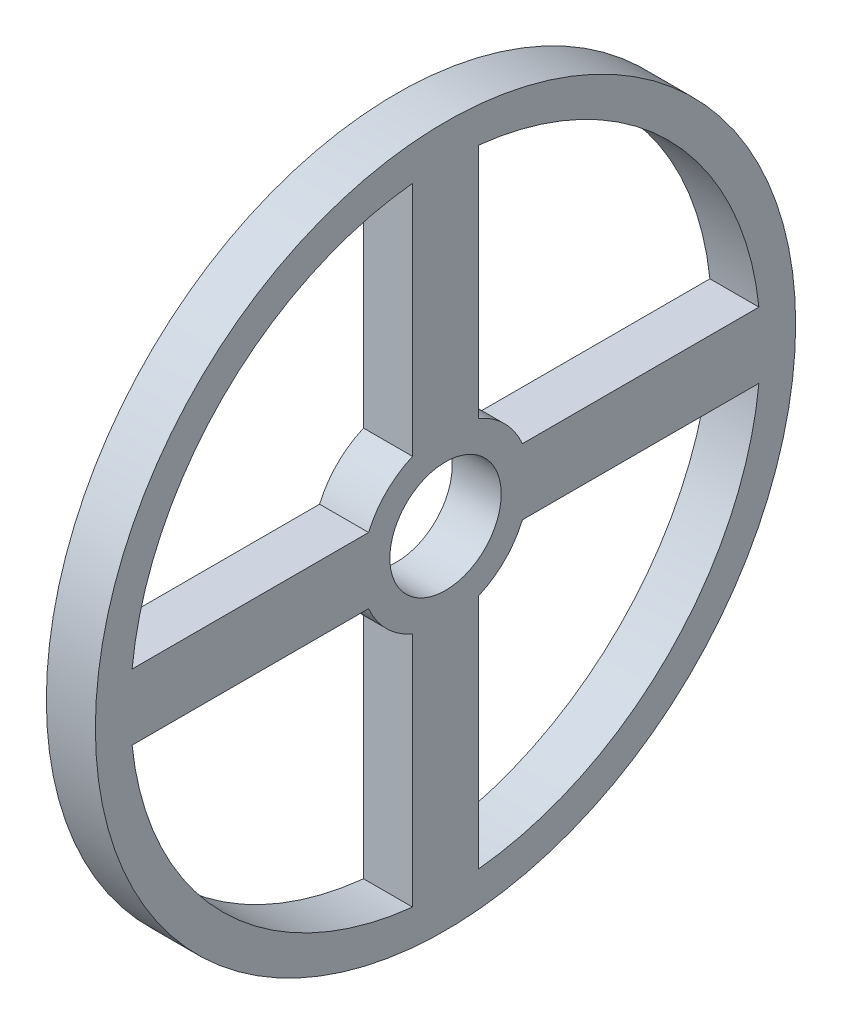
ISO-10303-21;
HEADER;
FILE_DESCRIPTION(('STEP AP214'),'2;1');
FILE_NAME('part.step','',(''),(''),'','','');
FILE_SCHEMA(('AUTOMOTIVE_DESIGN { 1 0 10303 214 1 1 1 1 }'));
ENDSEC;
DATA;
#1=APPLICATION_CONTEXT('core data for automotive mechanical design processes');
#2=APPLICATION_PROTOCOL_DEFINITION('international standard','automotive_design',2000,#1);
#3=PRODUCT_CONTEXT('',#1,'mechanical');
#4=PRODUCT('Part','Part','',(#3));
#5=PRODUCT_RELATED_PRODUCT_CATEGORY('part','',(#4));
#6=PRODUCT_DEFINITION_FORMATION('','',#4);
#7=PRODUCT_DEFINITION_CONTEXT('part definition',#1,'design');
#8=PRODUCT_DEFINITION('design','',#6,#7);
#9=PRODUCT_DEFINITION_SHAPE('','',#8);
#10=(LENGTH_UNIT() NAMED_UNIT(*) SI_UNIT(.MILLI.,.METRE.));
#11=(NAMED_UNIT(*) PLANE_ANGLE_UNIT() SI_UNIT($,.RADIAN.));
#12=(NAMED_UNIT(*) SI_UNIT($,.STERADIAN.) SOLID_ANGLE_UNIT());
#13=UNCERTAINTY_MEASURE_WITH_UNIT(LENGTH_MEASURE(1.E-05),#10,'distance_accuracy_value','');
#14=(GEOMETRIC_REPRESENTATION_CONTEXT(3) GLOBAL_UNCERTAINTY_ASSIGNED_CONTEXT((#13)) GLOBAL_UNIT_ASSIGNED_CONTEXT((#10,
#11,#12)) REPRESENTATION_CONTEXT('',''));
#15=CARTESIAN_POINT('',(0.,0.,0.));
#16=DIRECTION('',(0.,0.,1.));
#17=DIRECTION('',(1.,0.,0.));
#18=AXIS2_PLACEMENT_3D('',#15,#16,#17);
#19=CARTESIAN_POINT('',(7.,4.70886201161846,0.));
#20=DIRECTION('',(0.,-1.,0.));
#21=DIRECTION('',(0.,0.,-1.));
#22=AXIS2_PLACEMENT_3D('',#19,#20,#21);
#23=PLANE('',#22);
#24=DIRECTION('',(0.,0.,1.));
#25=VECTOR('',#24,1.);
#26=CARTESIAN_POINT('',(0.,4.70886201161846,0.));
#27=LINE('',#26,#25);
#28=CARTESIAN_POINT('',(0.,4.70886201161831,-44.7529509480161));
#29=VERTEX_POINT('',#28);
#30=CARTESIAN_POINT('',(0.,4.70886201161843,-10.9831288144835));
#31=VERTEX_POINT('',#30);
#32=EDGE_CURVE('E245',#29,#31,#27,.T.);
#33=ORIENTED_EDGE('',*,*,#32,.T.);
#34=DIRECTION('',(-1.,0.,0.));
#35=VECTOR('',#34,1.);
#36=CARTESIAN_POINT('',(7.,4.70886201161843,-10.9831288144835));
#37=LINE('',#36,#35);
#38=CARTESIAN_POINT('',(7.,4.70886201161843,-10.9831288144835));
#39=VERTEX_POINT('',#38);
#40=EDGE_CURVE('E11',#39,#31,#37,.T.);
#41=ORIENTED_EDGE('',*,*,#40,.F.);
#42=DIRECTION('',(0.,0.,1.));
#43=VECTOR('',#42,1.);
#44=CARTESIAN_POINT('',(7.,4.70886201161846,0.));
#45=LINE('',#44,#43);
#46=CARTESIAN_POINT('',(7.,4.70886201161831,-44.7529509480161));
#47=VERTEX_POINT('',#46);
#48=EDGE_CURVE('E169',#47,#39,#45,.T.);
#49=ORIENTED_EDGE('',*,*,#48,.F.);
#50=DIRECTION('',(-1.,0.,0.));
#51=VECTOR('',#50,1.);
#52=CARTESIAN_POINT('',(7.,4.70886201161831,-44.7529509480161));
#53=LINE('',#52,#51);
#54=EDGE_CURVE('E61',#47,#29,#53,.T.);
#55=ORIENTED_EDGE('',*,*,#54,.T.);
#56=EDGE_LOOP('',(#33,#41,#49,#55));
#57=FACE_BOUND('',#56,.T.);
#58=ADVANCED_FACE('F41',(#57),#23,.F.);
#59=CARTESIAN_POINT('',(7.,0.,0.));
#60=DIRECTION('',(-1.,0.,0.));
#61=DIRECTION('',(0.,0.,1.));
#62=AXIS2_PLACEMENT_3D('',#59,#60,#61);
#63=CYLINDRICAL_SURFACE('',#62,11.95);
#64=CARTESIAN_POINT('',(0.,0.,0.));
#65=DIRECTION('',(1.,0.,0.));
#66=DIRECTION('',(0.,0.,-1.));
#67=AXIS2_PLACEMENT_3D('',#64,#65,#66);
#68=CIRCLE('',#67,11.95);
#69=CARTESIAN_POINT('',(0.,10.9831288144834,-4.70886201161846));
#70=VERTEX_POINT('',#69);
#71=EDGE_CURVE('E176',#31,#70,#68,.T.);
#72=ORIENTED_EDGE('',*,*,#71,.T.);
#73=DIRECTION('',(-1.,0.,0.));
#74=VECTOR('',#73,1.);
#75=CARTESIAN_POINT('',(7.,10.9831288144834,-4.70886201161846));
#76=LINE('',#75,#74);
#77=CARTESIAN_POINT('',(7.,10.9831288144834,-4.70886201161846));
#78=VERTEX_POINT('',#77);
#79=EDGE_CURVE('E52',#78,#70,#76,.T.);
#80=ORIENTED_EDGE('',*,*,#79,.F.);
#81=CARTESIAN_POINT('',(7.,0.,0.));
#82=DIRECTION('',(1.,0.,0.));
#83=DIRECTION('',(0.,0.,-1.));
#84=AXIS2_PLACEMENT_3D('',#81,#82,#83);
#85=CIRCLE('',#84,11.95);
#86=EDGE_CURVE('E163',#39,#78,#85,.T.);
#87=ORIENTED_EDGE('',*,*,#86,.F.);
#88=ORIENTED_EDGE('',*,*,#40,.T.);
#89=EDGE_LOOP('',(#72,#80,#87,#88));
#90=FACE_BOUND('',#89,.T.);
#91=ADVANCED_FACE('F175',(#90),#63,.T.);
#92=CARTESIAN_POINT('',(7.,0.,-4.70886201161846));
#93=DIRECTION('',(0.,0.,-1.));
#94=DIRECTION('',(0.,1.,0.));
#95=AXIS2_PLACEMENT_3D('',#92,#93,#94);
#96=PLANE('',#95);
#97=DIRECTION('',(0.,-1.,0.));
#98=VECTOR('',#97,1.);
#99=CARTESIAN_POINT('',(0.,0.,-4.70886201161846));
#100=LINE('',#99,#98);
#101=CARTESIAN_POINT('',(0.,44.7529509480161,-4.70886201161846));
#102=VERTEX_POINT('',#101);
#103=EDGE_CURVE('E250',#102,#70,#100,.T.);
#104=ORIENTED_EDGE('',*,*,#103,.F.);
#105=DIRECTION('',(-1.,0.,0.));
#106=VECTOR('',#105,1.);
#107=CARTESIAN_POINT('',(7.,44.7529509480161,-4.70886201161846));
#108=LINE('',#107,#106);
#109=CARTESIAN_POINT('',(7.,44.7529509480161,-4.70886201161846));
#110=VERTEX_POINT('',#109);
#111=EDGE_CURVE('E111',#110,#102,#108,.T.);
#112=ORIENTED_EDGE('',*,*,#111,.F.);
#113=DIRECTION('',(0.,-1.,0.));
#114=VECTOR('',#113,1.);
#115=CARTESIAN_POINT('',(7.,0.,-4.70886201161846));
#116=LINE('',#115,#114);
#117=EDGE_CURVE('E168',#110,#78,#116,.T.);
#118=ORIENTED_EDGE('',*,*,#117,.T.);
#119=ORIENTED_EDGE('',*,*,#79,.T.);
#120=EDGE_LOOP('',(#104,#112,#118,#119));
#121=FACE_BOUND('',#120,.T.);
#122=ADVANCED_FACE('F181',(#121),#96,.T.);
#123=CARTESIAN_POINT('',(7.,0.,0.));
#124=DIRECTION('',(-1.,0.,0.));
#125=DIRECTION('',(0.,0.,1.));
#126=AXIS2_PLACEMENT_3D('',#123,#124,#125);
#127=CYLINDRICAL_SURFACE('',#126,45.);
#128=CARTESIAN_POINT('',(0.,0.,0.));
#129=DIRECTION('',(1.,0.,0.));
#130=DIRECTION('',(0.,0.,-1.));
#131=AXIS2_PLACEMENT_3D('',#128,#129,#130);
#132=CIRCLE('',#131,45.);
#133=CARTESIAN_POINT('',(0.,-4.708862011618,44.7529509480162));
#134=VERTEX_POINT('',#133);
#135=CARTESIAN_POINT('',(0.,-44.7529509480161,4.70886201161878));
#136=VERTEX_POINT('',#135);
#137=EDGE_CURVE('E221',#134,#136,#132,.T.);
#138=ORIENTED_EDGE('',*,*,#137,.F.);
#139=DIRECTION('',(-1.,0.,0.));
#140=VECTOR('',#139,1.);
#141=CARTESIAN_POINT('',(7.,-4.708862011618,44.7529509480162));
#142=LINE('',#141,#140);
#143=CARTESIAN_POINT('',(7.,-4.708862011618,44.7529509480162));
#144=VERTEX_POINT('',#143);
#145=EDGE_CURVE('E260',#144,#134,#142,.T.);
#146=ORIENTED_EDGE('',*,*,#145,.F.);
#147=CARTESIAN_POINT('',(7.,0.,0.));
#148=DIRECTION('',(1.,0.,0.));
#149=DIRECTION('',(0.,0.,-1.));
#150=AXIS2_PLACEMENT_3D('',#147,#148,#149);
#151=CIRCLE('',#150,45.);
#152=CARTESIAN_POINT('',(7.,-44.7529509480161,4.70886201161878));
#153=VERTEX_POINT('',#152);
#154=EDGE_CURVE('E518',#144,#153,#151,.T.);
#155=ORIENTED_EDGE('',*,*,#154,.T.);
#156=DIRECTION('',(-1.,0.,0.));
#157=VECTOR('',#156,1.);
#158=CARTESIAN_POINT('',(7.,-44.7529509480161,4.70886201161878));
#159=LINE('',#158,#157);
#160=EDGE_CURVE('E263',#153,#136,#159,.T.);
#161=ORIENTED_EDGE('',*,*,#160,.T.);
#162=EDGE_LOOP('',(#138,#146,#155,#161));
#163=FACE_BOUND('',#162,.T.);
#164=ADVANCED_FACE('F351',(#163),#127,.F.);
#165=CARTESIAN_POINT('',(7.,-4.70886201161846,0.));
#166=DIRECTION('',(0.,1.,0.));
#167=DIRECTION('',(0.,0.,1.));
#168=AXIS2_PLACEMENT_3D('',#165,#166,#167);
#169=PLANE('',#168);
#170=DIRECTION('',(0.,0.,-1.));
#171=VECTOR('',#170,1.);
#172=CARTESIAN_POINT('',(0.,-4.70886201161846,0.));
#173=LINE('',#172,#171);
#174=CARTESIAN_POINT('',(0.,-4.70886201161835,10.9831288144835));
#175=VERTEX_POINT('',#174);
#176=EDGE_CURVE('E225',#134,#175,#173,.T.);
#177=ORIENTED_EDGE('',*,*,#176,.T.);
#178=DIRECTION('',(-1.,0.,0.));
#179=VECTOR('',#178,1.);
#180=CARTESIAN_POINT('',(7.,-4.70886201161835,10.9831288144835));
#181=LINE('',#180,#179);
#182=CARTESIAN_POINT('',(7.,-4.70886201161835,10.9831288144835));
#183=VERTEX_POINT('',#182);
#184=EDGE_CURVE('E270',#183,#175,#181,.T.);
#185=ORIENTED_EDGE('',*,*,#184,.F.);
#186=DIRECTION('',(0.,0.,-1.));
#187=VECTOR('',#186,1.);
#188=CARTESIAN_POINT('',(7.,-4.70886201161846,0.));
#189=LINE('',#188,#187);
#190=EDGE_CURVE('E514',#144,#183,#189,.T.);
#191=ORIENTED_EDGE('',*,*,#190,.F.);
#192=ORIENTED_EDGE('',*,*,#145,.T.);
#193=EDGE_LOOP('',(#177,#185,#191,#192));
#194=FACE_BOUND('',#193,.T.);
#195=ADVANCED_FACE('F347',(#194),#169,.F.);
#196=CARTESIAN_POINT('',(7.,0.,0.));
#197=DIRECTION('',(-1.,0.,0.));
#198=DIRECTION('',(0.,0.,1.));
#199=AXIS2_PLACEMENT_3D('',#196,#197,#198);
#200=CYLINDRICAL_SURFACE('',#199,11.95);
#201=CARTESIAN_POINT('',(0.,0.,0.));
#202=DIRECTION('',(1.,0.,0.));
#203=DIRECTION('',(0.,0.,-1.));
#204=AXIS2_PLACEMENT_3D('',#201,#202,#203);
#205=CIRCLE('',#204,11.95);
#206=CARTESIAN_POINT('',(0.,-10.9831288144834,4.70886201161854));
#207=VERTEX_POINT('',#206);
#208=EDGE_CURVE('E229',#175,#207,#205,.T.);
#209=ORIENTED_EDGE('',*,*,#208,.T.);
#210=DIRECTION('',(-1.,0.,0.));
#211=VECTOR('',#210,1.);
#212=CARTESIAN_POINT('',(7.,-10.9831288144834,4.70886201161854));
#213=LINE('',#212,#211);
#214=CARTESIAN_POINT('',(7.,-10.9831288144834,4.70886201161854));
#215=VERTEX_POINT('',#214);
#216=EDGE_CURVE('E266',#215,#207,#213,.T.);
#217=ORIENTED_EDGE('',*,*,#216,.F.);
#218=CARTESIAN_POINT('',(7.,0.,0.));
#219=DIRECTION('',(1.,0.,0.));
#220=DIRECTION('',(0.,0.,-1.));
#221=AXIS2_PLACEMENT_3D('',#218,#219,#220);
#222=CIRCLE('',#221,11.95);
#223=EDGE_CURVE('E511',#183,#215,#222,.T.);
#224=ORIENTED_EDGE('',*,*,#223,.F.);
#225=ORIENTED_EDGE('',*,*,#184,.T.);
#226=EDGE_LOOP('',(#209,#217,#224,#225));
#227=FACE_BOUND('',#226,.T.);
#228=ADVANCED_FACE('F343',(#227),#200,.T.);
#229=CARTESIAN_POINT('',(7.,0.,0.));
#230=DIRECTION('',(-1.,0.,0.));
#231=DIRECTION('',(0.,0.,1.));
#232=AXIS2_PLACEMENT_3D('',#229,#230,#231);
#233=CYLINDRICAL_SURFACE('',#232,45.);
#234=CARTESIAN_POINT('',(0.,0.,0.));
#235=DIRECTION('',(1.,0.,0.));
#236=DIRECTION('',(0.,0.,-1.));
#237=AXIS2_PLACEMENT_3D('',#234,#235,#236);
#238=CIRCLE('',#237,45.);
#239=CARTESIAN_POINT('',(0.,44.7529509480161,4.70886201161846));
#240=VERTEX_POINT('',#239);
#241=CARTESIAN_POINT('',(0.,4.70886201161893,44.7529509480161));
#242=VERTEX_POINT('',#241);
#243=EDGE_CURVE('E205',#240,#242,#238,.T.);
#244=ORIENTED_EDGE('',*,*,#243,.F.);
#245=DIRECTION('',(-1.,0.,0.));
#246=VECTOR('',#245,1.);
#247=CARTESIAN_POINT('',(7.,44.7529509480161,4.70886201161846));
#248=LINE('',#247,#246);
#249=CARTESIAN_POINT('',(7.,44.7529509480161,4.70886201161846));
#250=VERTEX_POINT('',#249);
#251=EDGE_CURVE('E267',#250,#240,#248,.T.);
#252=ORIENTED_EDGE('',*,*,#251,.F.);
#253=CARTESIAN_POINT('',(7.,0.,0.));
#254=DIRECTION('',(1.,0.,0.));
#255=DIRECTION('',(0.,0.,-1.));
#256=AXIS2_PLACEMENT_3D('',#253,#254,#255);
#257=CIRCLE('',#256,45.);
#258=CARTESIAN_POINT('',(7.,4.70886201161893,44.7529509480161));
#259=VERTEX_POINT('',#258);
#260=EDGE_CURVE('E533',#250,#259,#257,.T.);
#261=ORIENTED_EDGE('',*,*,#260,.T.);
#262=DIRECTION('',(-1.,0.,0.));
#263=VECTOR('',#262,1.);
#264=CARTESIAN_POINT('',(7.,4.70886201161893,44.7529509480161));
#265=LINE('',#264,#263);
#266=EDGE_CURVE('E276',#259,#242,#265,.T.);
#267=ORIENTED_EDGE('',*,*,#266,.T.);
#268=EDGE_LOOP('',(#244,#252,#261,#267));
#269=FACE_BOUND('',#268,.T.);
#270=ADVANCED_FACE('F346',(#269),#233,.F.);
#271=CARTESIAN_POINT('',(7.,0.,4.70886201161846));
#272=DIRECTION('',(0.,0.,-1.));
#273=DIRECTION('',(0.,1.,0.));
#274=AXIS2_PLACEMENT_3D('',#271,#272,#273);
#275=PLANE('',#274);
#276=DIRECTION('',(0.,-1.,0.));
#277=VECTOR('',#276,1.);
#278=CARTESIAN_POINT('',(0.,0.,4.70886201161846));
#279=LINE('',#278,#277);
#280=CARTESIAN_POINT('',(0.,10.9831288144834,4.70886201161846));
#281=VERTEX_POINT('',#280);
#282=EDGE_CURVE('E209',#240,#281,#279,.T.);
#283=ORIENTED_EDGE('',*,*,#282,.T.);
#284=DIRECTION('',(-1.,0.,0.));
#285=VECTOR('',#284,1.);
#286=CARTESIAN_POINT('',(7.,10.9831288144834,4.70886201161846));
#287=LINE('',#286,#285);
#288=CARTESIAN_POINT('',(7.,10.9831288144834,4.70886201161846));
#289=VERTEX_POINT('',#288);
#290=EDGE_CURVE('E282',#289,#281,#287,.T.);
#291=ORIENTED_EDGE('',*,*,#290,.F.);
#292=DIRECTION('',(0.,-1.,0.));
#293=VECTOR('',#292,1.);
#294=CARTESIAN_POINT('',(7.,0.,4.70886201161846));
#295=LINE('',#294,#293);
#296=EDGE_CURVE('E529',#250,#289,#295,.T.);
#297=ORIENTED_EDGE('',*,*,#296,.F.);
#298=ORIENTED_EDGE('',*,*,#251,.T.);
#299=EDGE_LOOP('',(#283,#291,#297,#298));
#300=FACE_BOUND('',#299,.T.);
#301=ADVANCED_FACE('F362',(#300),#275,.F.);
#302=CARTESIAN_POINT('',(7.,0.,0.));
#303=DIRECTION('',(-1.,0.,0.));
#304=DIRECTION('',(0.,0.,1.));
#305=AXIS2_PLACEMENT_3D('',#302,#303,#304);
#306=CYLINDRICAL_SURFACE('',#305,11.95);
#307=CARTESIAN_POINT('',(0.,0.,0.));
#308=DIRECTION('',(1.,0.,0.));
#309=DIRECTION('',(0.,0.,-1.));
#310=AXIS2_PLACEMENT_3D('',#307,#308,#309);
#311=CIRCLE('',#310,11.95);
#312=CARTESIAN_POINT('',(0.,4.70886201161858,10.9831288144834));
#313=VERTEX_POINT('',#312);
#314=EDGE_CURVE('E213',#281,#313,#311,.T.);
#315=ORIENTED_EDGE('',*,*,#314,.T.);
#316=DIRECTION('',(-1.,0.,0.));
#317=VECTOR('',#316,1.);
#318=CARTESIAN_POINT('',(7.,4.70886201161858,10.9831288144834));
#319=LINE('',#318,#317);
#320=CARTESIAN_POINT('',(7.,4.70886201161858,10.9831288144834));
#321=VERTEX_POINT('',#320);
#322=EDGE_CURVE('E279',#321,#313,#319,.T.);
#323=ORIENTED_EDGE('',*,*,#322,.F.);
#324=CARTESIAN_POINT('',(7.,0.,0.));
#325=DIRECTION('',(1.,0.,0.));
#326=DIRECTION('',(0.,0.,-1.));
#327=AXIS2_PLACEMENT_3D('',#324,#325,#326);
#328=CIRCLE('',#327,11.95);
#329=EDGE_CURVE('E526',#289,#321,#328,.T.);
#330=ORIENTED_EDGE('',*,*,#329,.F.);
#331=ORIENTED_EDGE('',*,*,#290,.T.);
#332=EDGE_LOOP('',(#315,#323,#330,#331));
#333=FACE_BOUND('',#332,.T.);
#334=ADVANCED_FACE('F359',(#333),#306,.T.);
#335=CARTESIAN_POINT('',(7.,0.,0.));
#336=DIRECTION('',(-1.,0.,0.));
#337=DIRECTION('',(0.,0.,1.));
#338=AXIS2_PLACEMENT_3D('',#335,#336,#337);
#339=CYLINDRICAL_SURFACE('',#338,45.);
#340=CARTESIAN_POINT('',(0.,0.,0.));
#341=DIRECTION('',(1.,0.,0.));
#342=DIRECTION('',(0.,0.,-1.));
#343=AXIS2_PLACEMENT_3D('',#340,#341,#342);
#344=CIRCLE('',#343,45.);
#345=CARTESIAN_POINT('',(0.,-44.7529509480161,-4.70886201161815));
#346=VERTEX_POINT('',#345);
#347=CARTESIAN_POINT('',(0.,-4.70886201161862,-44.7529509480161));
#348=VERTEX_POINT('',#347);
#349=EDGE_CURVE('E190',#346,#348,#344,.T.);
#350=ORIENTED_EDGE('',*,*,#349,.F.);
#351=DIRECTION('',(-1.,0.,0.));
#352=VECTOR('',#351,1.);
#353=CARTESIAN_POINT('',(7.,-44.7529509480161,-4.70886201161815));
#354=LINE('',#353,#352);
#355=CARTESIAN_POINT('',(7.,-44.7529509480161,-4.70886201161815));
#356=VERTEX_POINT('',#355);
#357=EDGE_CURVE('E45',#356,#346,#354,.T.);
#358=ORIENTED_EDGE('',*,*,#357,.F.);
#359=CARTESIAN_POINT('',(7.,0.,0.));
#360=DIRECTION('',(1.,0.,0.));
#361=DIRECTION('',(0.,0.,-1.));
#362=AXIS2_PLACEMENT_3D('',#359,#360,#361);
#363=CIRCLE('',#362,45.);
#364=CARTESIAN_POINT('',(7.,-4.70886201161862,-44.7529509480161));
#365=VERTEX_POINT('',#364);
#366=EDGE_CURVE('E257',#356,#365,#363,.T.);
#367=ORIENTED_EDGE('',*,*,#366,.T.);
#368=DIRECTION('',(-1.,0.,0.));
#369=VECTOR('',#368,1.);
#370=CARTESIAN_POINT('',(7.,-4.70886201161862,-44.7529509480161));
#371=LINE('',#370,#369);
#372=EDGE_CURVE('E186',#365,#348,#371,.T.);
#373=ORIENTED_EDGE('',*,*,#372,.T.);
#374=EDGE_LOOP('',(#350,#358,#367,#373));
#375=FACE_BOUND('',#374,.T.);
#376=ADVANCED_FACE('F43',(#375),#339,.F.);
#377=CARTESIAN_POINT('',(7.,0.,-4.70886201161846));
#378=DIRECTION('',(0.,0.,1.));
#379=DIRECTION('',(0.,-1.,0.));
#380=AXIS2_PLACEMENT_3D('',#377,#378,#379);
#381=PLANE('',#380);
#382=DIRECTION('',(0.,1.,0.));
#383=VECTOR('',#382,1.);
#384=CARTESIAN_POINT('',(0.,0.,-4.70886201161846));
#385=LINE('',#384,#383);
#386=CARTESIAN_POINT('',(0.,-10.9831288144835,-4.70886201161839));
#387=VERTEX_POINT('',#386);
#388=EDGE_CURVE('E194',#346,#387,#385,.T.);
#389=ORIENTED_EDGE('',*,*,#388,.T.);
#390=DIRECTION('',(-1.,0.,0.));
#391=VECTOR('',#390,1.);
#392=CARTESIAN_POINT('',(7.,-10.9831288144835,-4.70886201161839));
#393=LINE('',#392,#391);
#394=CARTESIAN_POINT('',(7.,-10.9831288144835,-4.70886201161839));
#395=VERTEX_POINT('',#394);
#396=EDGE_CURVE('E292',#395,#387,#393,.T.);
#397=ORIENTED_EDGE('',*,*,#396,.F.);
#398=DIRECTION('',(0.,1.,0.));
#399=VECTOR('',#398,1.);
#400=CARTESIAN_POINT('',(7.,0.,-4.70886201161846));
#401=LINE('',#400,#399);
#402=EDGE_CURVE('E303',#356,#395,#401,.T.);
#403=ORIENTED_EDGE('',*,*,#402,.F.);
#404=ORIENTED_EDGE('',*,*,#357,.T.);
#405=EDGE_LOOP('',(#389,#397,#403,#404));
#406=FACE_BOUND('',#405,.T.);
#407=ADVANCED_FACE('F302',(#406),#381,.F.);
#408=CARTESIAN_POINT('',(7.,0.,0.));
#409=DIRECTION('',(-1.,0.,0.));
#410=DIRECTION('',(0.,0.,1.));
#411=AXIS2_PLACEMENT_3D('',#408,#409,#410);
#412=CYLINDRICAL_SURFACE('',#411,11.95);
#413=CARTESIAN_POINT('',(0.,0.,0.));
#414=DIRECTION('',(1.,0.,0.));
#415=DIRECTION('',(0.,0.,-1.));
#416=AXIS2_PLACEMENT_3D('',#413,#414,#415);
#417=CIRCLE('',#416,11.95);
#418=CARTESIAN_POINT('',(0.,-4.7088620116185,-10.9831288144834));
#419=VERTEX_POINT('',#418);
#420=EDGE_CURVE('E197',#387,#419,#417,.T.);
#421=ORIENTED_EDGE('',*,*,#420,.T.);
#422=DIRECTION('',(-1.,0.,0.));
#423=VECTOR('',#422,1.);
#424=CARTESIAN_POINT('',(7.,-4.7088620116185,-10.9831288144834));
#425=LINE('',#424,#423);
#426=CARTESIAN_POINT('',(7.,-4.7088620116185,-10.9831288144834));
#427=VERTEX_POINT('',#426);
#428=EDGE_CURVE('E290',#427,#419,#425,.T.);
#429=ORIENTED_EDGE('',*,*,#428,.F.);
#430=CARTESIAN_POINT('',(7.,0.,0.));
#431=DIRECTION('',(1.,0.,0.));
#432=DIRECTION('',(0.,0.,-1.));
#433=AXIS2_PLACEMENT_3D('',#430,#431,#432);
#434=CIRCLE('',#433,11.95);
#435=EDGE_CURVE('E539',#395,#427,#434,.T.);
#436=ORIENTED_EDGE('',*,*,#435,.F.);
#437=ORIENTED_EDGE('',*,*,#396,.T.);
#438=EDGE_LOOP('',(#421,#429,#436,#437));
#439=FACE_BOUND('',#438,.T.);
#440=ADVANCED_FACE('F315',(#439),#412,.T.);
#441=CARTESIAN_POINT('',(7.,0.,0.));
#442=DIRECTION('',(-1.,0.,0.));
#443=DIRECTION('',(0.,0.,1.));
#444=AXIS2_PLACEMENT_3D('',#441,#442,#443);
#445=CYLINDRICAL_SURFACE('',#444,50.);
#446=CARTESIAN_POINT('',(7.,0.,0.));
#447=DIRECTION('',(1.,0.,0.));
#448=DIRECTION('',(0.,0.,-1.));
#449=AXIS2_PLACEMENT_3D('',#446,#447,#448);
#450=CIRCLE('',#449,50.);
#451=CARTESIAN_POINT('',(7.,0.,-50.));
#452=VERTEX_POINT('',#451);
#453=EDGE_CURVE('E498',#452,#452,#450,.T.);
#454=ORIENTED_EDGE('',*,*,#453,.F.);
#455=EDGE_LOOP('',(#454));
#456=FACE_BOUND('',#455,.T.);
#457=CARTESIAN_POINT('',(0.,0.,0.));
#458=DIRECTION('',(1.,0.,0.));
#459=DIRECTION('',(0.,0.,-1.));
#460=AXIS2_PLACEMENT_3D('',#457,#458,#459);
#461=CIRCLE('',#460,50.);
#462=CARTESIAN_POINT('',(0.,0.,-50.));
#463=VERTEX_POINT('',#462);
#464=EDGE_CURVE('E241',#463,#463,#461,.T.);
#465=ORIENTED_EDGE('',*,*,#464,.T.);
#466=EDGE_LOOP('',(#465));
#467=FACE_BOUND('',#466,.T.);
#468=ADVANCED_FACE('F317',(#456,#467),#445,.T.);
#469=CARTESIAN_POINT('',(7.,0.,0.));
#470=DIRECTION('',(-1.,0.,0.));
#471=DIRECTION('',(0.,0.,1.));
#472=AXIS2_PLACEMENT_3D('',#469,#470,#471);
#473=CYLINDRICAL_SURFACE('',#472,7.95);
#474=CARTESIAN_POINT('',(7.,0.,0.));
#475=DIRECTION('',(1.,0.,0.));
#476=DIRECTION('',(0.,0.,-1.));
#477=AXIS2_PLACEMENT_3D('',#474,#475,#476);
#478=CIRCLE('',#477,7.95);
#479=CARTESIAN_POINT('',(7.,0.,-7.95));
#480=VERTEX_POINT('',#479);
#481=EDGE_CURVE('E501',#480,#480,#478,.T.);
#482=ORIENTED_EDGE('',*,*,#481,.T.);
#483=EDGE_LOOP('',(#482));
#484=FACE_BOUND('',#483,.T.);
#485=CARTESIAN_POINT('',(0.,0.,0.));
#486=DIRECTION('',(1.,0.,0.));
#487=DIRECTION('',(0.,0.,-1.));
#488=AXIS2_PLACEMENT_3D('',#485,#486,#487);
#489=CIRCLE('',#488,7.95);
#490=CARTESIAN_POINT('',(0.,0.,-7.95));
#491=VERTEX_POINT('',#490);
#492=EDGE_CURVE('E237',#491,#491,#489,.T.);
#493=ORIENTED_EDGE('',*,*,#492,.F.);
#494=EDGE_LOOP('',(#493));
#495=FACE_BOUND('',#494,.T.);
#496=ADVANCED_FACE('F323',(#484,#495),#473,.F.);
#497=CARTESIAN_POINT('',(7.,0.,4.70886201161846));
#498=DIRECTION('',(0.,0.,1.));
#499=DIRECTION('',(0.,-1.,0.));
#500=AXIS2_PLACEMENT_3D('',#497,#498,#499);
#501=PLANE('',#500);
#502=DIRECTION('',(0.,1.,0.));
#503=VECTOR('',#502,1.);
#504=CARTESIAN_POINT('',(0.,0.,4.70886201161846));
#505=LINE('',#504,#503);
#506=EDGE_CURVE('E233',#136,#207,#505,.T.);
#507=ORIENTED_EDGE('',*,*,#506,.F.);
#508=ORIENTED_EDGE('',*,*,#160,.F.);
#509=DIRECTION('',(0.,1.,0.));
#510=VECTOR('',#509,1.);
#511=CARTESIAN_POINT('',(7.,0.,4.70886201161846));
#512=LINE('',#511,#510);
#513=EDGE_CURVE('E507',#153,#215,#512,.T.);
#514=ORIENTED_EDGE('',*,*,#513,.T.);
#515=ORIENTED_EDGE('',*,*,#216,.T.);
#516=EDGE_LOOP('',(#507,#508,#514,#515));
#517=FACE_BOUND('',#516,.T.);
#518=ADVANCED_FACE('F337',(#517),#501,.T.);
#519=CARTESIAN_POINT('',(7.,4.70886201161846,0.));
#520=DIRECTION('',(0.,1.,0.));
#521=DIRECTION('',(0.,0.,1.));
#522=AXIS2_PLACEMENT_3D('',#519,#520,#521);
#523=PLANE('',#522);
#524=DIRECTION('',(0.,0.,-1.));
#525=VECTOR('',#524,1.);
#526=CARTESIAN_POINT('',(0.,4.70886201161846,0.));
#527=LINE('',#526,#525);
#528=EDGE_CURVE('E217',#242,#313,#527,.T.);
#529=ORIENTED_EDGE('',*,*,#528,.F.);
#530=ORIENTED_EDGE('',*,*,#266,.F.);
#531=DIRECTION('',(0.,0.,-1.));
#532=VECTOR('',#531,1.);
#533=CARTESIAN_POINT('',(7.,4.70886201161846,0.));
#534=LINE('',#533,#532);
#535=EDGE_CURVE('E522',#259,#321,#534,.T.);
#536=ORIENTED_EDGE('',*,*,#535,.T.);
#537=ORIENTED_EDGE('',*,*,#322,.T.);
#538=EDGE_LOOP('',(#529,#530,#536,#537));
#539=FACE_BOUND('',#538,.T.);
#540=ADVANCED_FACE('F341',(#539),#523,.T.);
#541=CARTESIAN_POINT('',(7.,-4.70886201161846,0.));
#542=DIRECTION('',(0.,-1.,0.));
#543=DIRECTION('',(0.,0.,-1.));
#544=AXIS2_PLACEMENT_3D('',#541,#542,#543);
#545=PLANE('',#544);
#546=DIRECTION('',(0.,0.,1.));
#547=VECTOR('',#546,1.);
#548=CARTESIAN_POINT('',(0.,-4.70886201161846,0.));
#549=LINE('',#548,#547);
#550=EDGE_CURVE('E201',#348,#419,#549,.T.);
#551=ORIENTED_EDGE('',*,*,#550,.F.);
#552=ORIENTED_EDGE('',*,*,#372,.F.);
#553=DIRECTION('',(0.,0.,1.));
#554=VECTOR('',#553,1.);
#555=CARTESIAN_POINT('',(7.,-4.70886201161846,0.));
#556=LINE('',#555,#554);
#557=EDGE_CURVE('E313',#365,#427,#556,.T.);
#558=ORIENTED_EDGE('',*,*,#557,.T.);
#559=ORIENTED_EDGE('',*,*,#428,.T.);
#560=EDGE_LOOP('',(#551,#552,#558,#559));
#561=FACE_BOUND('',#560,.T.);
#562=ADVANCED_FACE('F312',(#561),#545,.T.);
#563=CARTESIAN_POINT('',(7.,0.,0.));
#564=DIRECTION('',(-1.,0.,0.));
#565=DIRECTION('',(0.,0.,1.));
#566=AXIS2_PLACEMENT_3D('',#563,#564,#565);
#567=CYLINDRICAL_SURFACE('',#566,45.);
#568=CARTESIAN_POINT('',(0.,0.,0.));
#569=DIRECTION('',(1.,0.,0.));
#570=DIRECTION('',(0.,0.,-1.));
#571=AXIS2_PLACEMENT_3D('',#568,#569,#570);
#572=CIRCLE('',#571,45.);
#573=EDGE_CURVE('E253',#29,#102,#572,.T.);
#574=ORIENTED_EDGE('',*,*,#573,.F.);
#575=ORIENTED_EDGE('',*,*,#54,.F.);
#576=CARTESIAN_POINT('',(7.,0.,0.));
#577=DIRECTION('',(1.,0.,0.));
#578=DIRECTION('',(0.,0.,-1.));
#579=AXIS2_PLACEMENT_3D('',#576,#577,#578);
#580=CIRCLE('',#579,45.);
#581=EDGE_CURVE('E183',#47,#110,#580,.T.);
#582=ORIENTED_EDGE('',*,*,#581,.T.);
#583=ORIENTED_EDGE('',*,*,#111,.T.);
#584=EDGE_LOOP('',(#574,#575,#582,#583));
#585=FACE_BOUND('',#584,.T.);
#586=ADVANCED_FACE('F370',(#585),#567,.F.);
#587=CARTESIAN_POINT('',(7.,0.,0.));
#588=DIRECTION('',(1.,0.,0.));
#589=DIRECTION('',(0.,0.,-1.));
#590=AXIS2_PLACEMENT_3D('',#587,#588,#589);
#591=PLANE('',#590);
#592=ORIENTED_EDGE('',*,*,#366,.F.);
#593=ORIENTED_EDGE('',*,*,#402,.T.);
#594=ORIENTED_EDGE('',*,*,#435,.T.);
#595=ORIENTED_EDGE('',*,*,#557,.F.);
#596=EDGE_LOOP('',(#592,#593,#594,#595));
#597=FACE_BOUND('',#596,.T.);
#598=ORIENTED_EDGE('',*,*,#260,.F.);
#599=ORIENTED_EDGE('',*,*,#296,.T.);
#600=ORIENTED_EDGE('',*,*,#329,.T.);
#601=ORIENTED_EDGE('',*,*,#535,.F.);
#602=EDGE_LOOP('',(#598,#599,#600,#601));
#603=FACE_BOUND('',#602,.T.);
#604=ORIENTED_EDGE('',*,*,#154,.F.);
#605=ORIENTED_EDGE('',*,*,#190,.T.);
#606=ORIENTED_EDGE('',*,*,#223,.T.);
#607=ORIENTED_EDGE('',*,*,#513,.F.);
#608=EDGE_LOOP('',(#604,#605,#606,#607));
#609=FACE_BOUND('',#608,.T.);
#610=ORIENTED_EDGE('',*,*,#481,.F.);
#611=EDGE_LOOP('',(#610));
#612=FACE_BOUND('',#611,.T.);
#613=ORIENTED_EDGE('',*,*,#453,.T.);
#614=EDGE_LOOP('',(#613));
#615=FACE_BOUND('',#614,.T.);
#616=ORIENTED_EDGE('',*,*,#48,.T.);
#617=ORIENTED_EDGE('',*,*,#86,.T.);
#618=ORIENTED_EDGE('',*,*,#117,.F.);
#619=ORIENTED_EDGE('',*,*,#581,.F.);
#620=EDGE_LOOP('',(#616,#617,#618,#619));
#621=FACE_BOUND('',#620,.T.);
#622=ADVANCED_FACE('F165',(#597,#603,#609,#612,#615,#621),#591,.T.);
#623=CARTESIAN_POINT('',(0.,0.,0.));
#624=DIRECTION('',(1.,0.,0.));
#625=DIRECTION('',(0.,0.,-1.));
#626=AXIS2_PLACEMENT_3D('',#623,#624,#625);
#627=PLANE('',#626);
#628=ORIENTED_EDGE('',*,*,#349,.T.);
#629=ORIENTED_EDGE('',*,*,#550,.T.);
#630=ORIENTED_EDGE('',*,*,#420,.F.);
#631=ORIENTED_EDGE('',*,*,#388,.F.);
#632=EDGE_LOOP('',(#628,#629,#630,#631));
#633=FACE_BOUND('',#632,.T.);
#634=ORIENTED_EDGE('',*,*,#243,.T.);
#635=ORIENTED_EDGE('',*,*,#528,.T.);
#636=ORIENTED_EDGE('',*,*,#314,.F.);
#637=ORIENTED_EDGE('',*,*,#282,.F.);
#638=EDGE_LOOP('',(#634,#635,#636,#637));
#639=FACE_BOUND('',#638,.T.);
#640=ORIENTED_EDGE('',*,*,#137,.T.);
#641=ORIENTED_EDGE('',*,*,#506,.T.);
#642=ORIENTED_EDGE('',*,*,#208,.F.);
#643=ORIENTED_EDGE('',*,*,#176,.F.);
#644=EDGE_LOOP('',(#640,#641,#642,#643));
#645=FACE_BOUND('',#644,.T.);
#646=ORIENTED_EDGE('',*,*,#492,.T.);
#647=EDGE_LOOP('',(#646));
#648=FACE_BOUND('',#647,.T.);
#649=ORIENTED_EDGE('',*,*,#464,.F.);
#650=EDGE_LOOP('',(#649));
#651=FACE_BOUND('',#650,.T.);
#652=ORIENTED_EDGE('',*,*,#32,.F.);
#653=ORIENTED_EDGE('',*,*,#573,.T.);
#654=ORIENTED_EDGE('',*,*,#103,.T.);
#655=ORIENTED_EDGE('',*,*,#71,.F.);
#656=EDGE_LOOP('',(#652,#653,#654,#655));
#657=FACE_BOUND('',#656,.T.);
#658=ADVANCED_FACE('F306',(#633,#639,#645,#648,#651,#657),#627,.F.);
#659=CLOSED_SHELL('',(#58,#91,#122,#164,#195,#228,#270,#301,#334,#376,#407,#440,#468,#496,#518,
#540,#562,#586,#622,#658));
#660=MANIFOLD_SOLID_BREP('B2',#659);
#661=ADVANCED_BREP_SHAPE_REPRESENTATION('',(#18,#660),#14);
#662=SHAPE_DEFINITION_REPRESENTATION(#9,#661);
ENDSEC;
END-ISO-10303-21;
